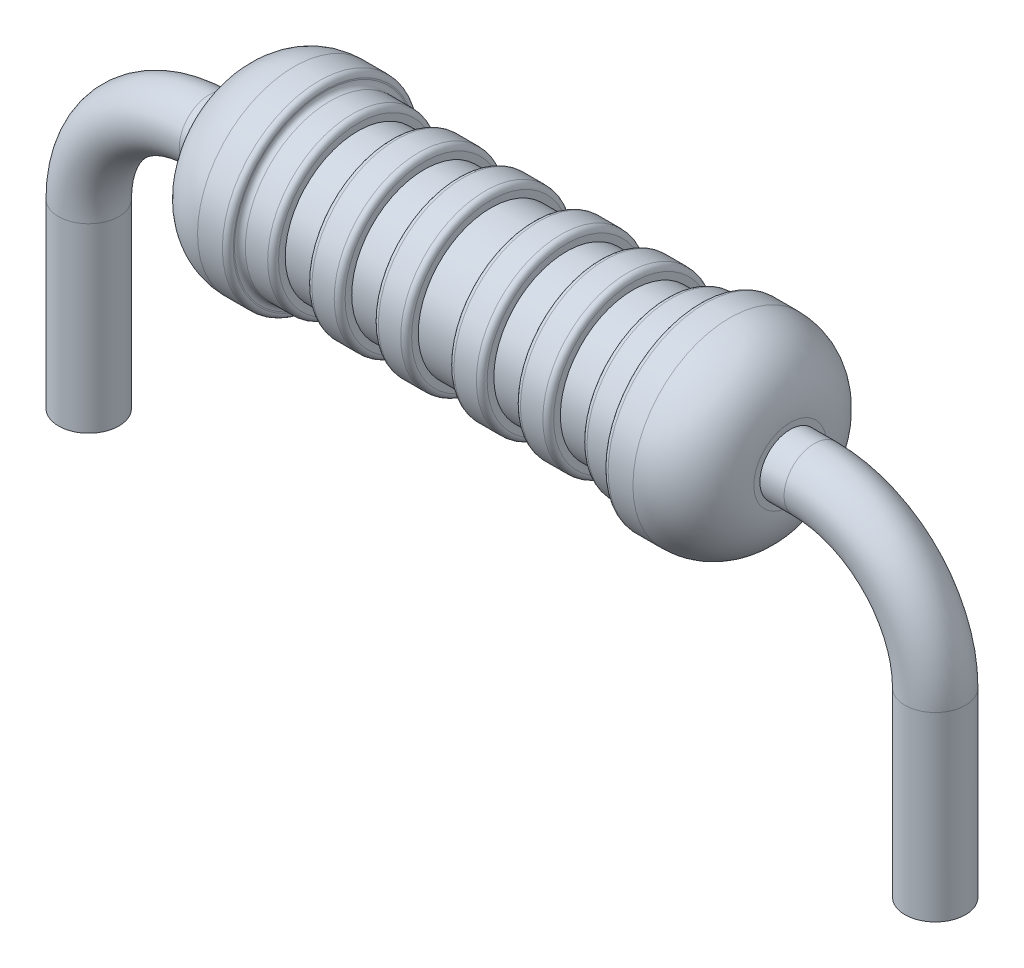
ISO-10303-21;
HEADER;
FILE_DESCRIPTION(('STEP AP214'),'2;1');
FILE_NAME('part.step','',(''),(''),'','','');
FILE_SCHEMA(('AUTOMOTIVE_DESIGN { 1 0 10303 214 1 1 1 1 }'));
ENDSEC;
DATA;
#1=APPLICATION_CONTEXT('core data for automotive mechanical design processes');
#2=APPLICATION_PROTOCOL_DEFINITION('international standard','automotive_design',2000,#1);
#3=PRODUCT_CONTEXT('',#1,'mechanical');
#4=PRODUCT('Part','Part','',(#3));
#5=PRODUCT_RELATED_PRODUCT_CATEGORY('part','',(#4));
#6=PRODUCT_DEFINITION_FORMATION('','',#4);
#7=PRODUCT_DEFINITION_CONTEXT('part definition',#1,'design');
#8=PRODUCT_DEFINITION('design','',#6,#7);
#9=PRODUCT_DEFINITION_SHAPE('','',#8);
#10=(LENGTH_UNIT() NAMED_UNIT(*) SI_UNIT(.MILLI.,.METRE.));
#11=(NAMED_UNIT(*) PLANE_ANGLE_UNIT() SI_UNIT($,.RADIAN.));
#12=(NAMED_UNIT(*) SI_UNIT($,.STERADIAN.) SOLID_ANGLE_UNIT());
#13=UNCERTAINTY_MEASURE_WITH_UNIT(LENGTH_MEASURE(1.E-05),#10,'distance_accuracy_value','');
#14=(GEOMETRIC_REPRESENTATION_CONTEXT(3) GLOBAL_UNCERTAINTY_ASSIGNED_CONTEXT((#13)) GLOBAL_UNIT_ASSIGNED_CONTEXT((#10,
#11,#12)) REPRESENTATION_CONTEXT('',''));
#15=CARTESIAN_POINT('',(0.,0.,0.));
#16=DIRECTION('',(0.,0.,1.));
#17=DIRECTION('',(1.,0.,0.));
#18=AXIS2_PLACEMENT_3D('',#15,#16,#17);
#19=CARTESIAN_POINT('',(5.,5.,0.));
#20=DIRECTION('',(-1.,0.,0.));
#21=DIRECTION('',(0.,0.,1.));
#22=AXIS2_PLACEMENT_3D('',#19,#20,#21);
#23=CYLINDRICAL_SURFACE('',#22,0.500000000000001);
#24=CARTESIAN_POINT('',(4.6,5.,0.));
#25=DIRECTION('',(1.,0.,0.));
#26=DIRECTION('',(0.,0.,-1.));
#27=AXIS2_PLACEMENT_3D('',#24,#25,#26);
#28=CIRCLE('',#27,0.500000000000001);
#29=CARTESIAN_POINT('',(4.6,5.,-0.500000000000001));
#30=VERTEX_POINT('',#29);
#31=EDGE_CURVE('E46',#30,#30,#28,.T.);
#32=ORIENTED_EDGE('',*,*,#31,.T.);
#33=EDGE_LOOP('',(#32));
#34=FACE_BOUND('',#33,.T.);
#35=CARTESIAN_POINT('',(5.,5.,0.));
#36=DIRECTION('',(1.,0.,0.));
#37=DIRECTION('',(0.,0.,1.));
#38=AXIS2_PLACEMENT_3D('',#35,#36,#37);
#39=CIRCLE('',#38,0.500000000000001);
#40=CARTESIAN_POINT('',(5.,5.5,0.));
#41=VERTEX_POINT('',#40);
#42=EDGE_CURVE('E448',#41,#41,#39,.T.);
#43=ORIENTED_EDGE('',*,*,#42,.F.);
#44=EDGE_LOOP('',(#43));
#45=FACE_BOUND('',#44,.T.);
#46=ADVANCED_FACE('F42',(#34,#45),#23,.T.);
#47=CARTESIAN_POINT('',(7.,0.,0.));
#48=DIRECTION('',(0.,-1.,0.));
#49=DIRECTION('',(0.,0.,1.));
#50=AXIS2_PLACEMENT_3D('',#47,#48,#49);
#51=PLANE('',#50);
#52=CARTESIAN_POINT('',(7.,0.,0.));
#53=DIRECTION('',(0.,-1.,0.));
#54=DIRECTION('',(0.,0.,1.));
#55=AXIS2_PLACEMENT_3D('',#52,#53,#54);
#56=CIRCLE('',#55,0.500000000000001);
#57=CARTESIAN_POINT('',(7.,0.,0.500000000000001));
#58=VERTEX_POINT('',#57);
#59=EDGE_CURVE('E58',#58,#58,#56,.T.);
#60=ORIENTED_EDGE('',*,*,#59,.T.);
#61=EDGE_LOOP('',(#60));
#62=FACE_BOUND('',#61,.T.);
#63=ADVANCED_FACE('F44',(#62),#51,.T.);
#64=CARTESIAN_POINT('',(7.,0.,0.));
#65=DIRECTION('',(0.,1.,0.));
#66=DIRECTION('',(-1.,0.,0.));
#67=AXIS2_PLACEMENT_3D('',#64,#65,#66);
#68=CYLINDRICAL_SURFACE('',#67,0.500000000000001);
#69=CARTESIAN_POINT('',(7.,3.,0.));
#70=DIRECTION('',(0.,-1.,0.));
#71=DIRECTION('',(0.,0.,1.));
#72=AXIS2_PLACEMENT_3D('',#69,#70,#71);
#73=CIRCLE('',#72,0.500000000000001);
#74=CARTESIAN_POINT('',(7.5,3.,0.));
#75=VERTEX_POINT('',#74);
#76=EDGE_CURVE('E444',#75,#75,#73,.T.);
#77=ORIENTED_EDGE('',*,*,#76,.T.);
#78=EDGE_LOOP('',(#77));
#79=FACE_BOUND('',#78,.T.);
#80=ORIENTED_EDGE('',*,*,#59,.F.);
#81=EDGE_LOOP('',(#80));
#82=FACE_BOUND('',#81,.T.);
#83=ADVANCED_FACE('F84',(#79,#82),#68,.T.);
#84=CARTESIAN_POINT('',(5.,3.,0.));
#85=DIRECTION('',(0.,0.,1.));
#86=DIRECTION('',(1.,0.,0.));
#87=AXIS2_PLACEMENT_3D('',#84,#85,#86);
#88=TOROIDAL_SURFACE('',#87,2.,0.500000000000001);
#89=CARTESIAN_POINT('',(5.,3.,0.));
#90=DIRECTION('',(0.,0.,1.));
#91=DIRECTION('',(1.,0.,0.));
#92=AXIS2_PLACEMENT_3D('',#89,#90,#91);
#93=CIRCLE('',#92,2.5);
#94=EDGE_CURVE('',#75,#41,#93,.T.);
#95=ORIENTED_EDGE('',*,*,#76,.F.);
#96=ORIENTED_EDGE('',*,*,#42,.T.);
#97=ORIENTED_EDGE('',*,*,#94,.T.);
#98=ORIENTED_EDGE('',*,*,#94,.F.);
#99=EDGE_LOOP('',(#95,#97,#96,#98));
#100=FACE_BOUND('',#99,.T.);
#101=ADVANCED_FACE('F80',(#100),#88,.T.);
#102=CARTESIAN_POINT('',(-4.6,5.,0.));
#103=DIRECTION('',(-1.,0.,0.));
#104=DIRECTION('',(0.,0.,1.));
#105=AXIS2_PLACEMENT_3D('',#102,#103,#104);
#106=CYLINDRICAL_SURFACE('',#105,1.2);
#107=CARTESIAN_POINT('',(-2.,5.,0.));
#108=DIRECTION('',(-1.,0.,0.));
#109=DIRECTION('',(0.,0.,1.));
#110=AXIS2_PLACEMENT_3D('',#107,#108,#109);
#111=CIRCLE('',#110,1.2);
#112=CARTESIAN_POINT('',(-2.,5.,1.2));
#113=VERTEX_POINT('',#112);
#114=EDGE_CURVE('E437',#113,#113,#111,.T.);
#115=ORIENTED_EDGE('',*,*,#114,.T.);
#116=EDGE_LOOP('',(#115));
#117=FACE_BOUND('',#116,.T.);
#118=CARTESIAN_POINT('',(-2.55,5.,0.));
#119=DIRECTION('',(-1.,0.,0.));
#120=DIRECTION('',(0.,0.,1.));
#121=AXIS2_PLACEMENT_3D('',#118,#119,#120);
#122=CIRCLE('',#121,1.2);
#123=CARTESIAN_POINT('',(-2.55,5.,1.2));
#124=VERTEX_POINT('',#123);
#125=EDGE_CURVE('E287',#124,#124,#122,.T.);
#126=ORIENTED_EDGE('',*,*,#125,.F.);
#127=EDGE_LOOP('',(#126));
#128=FACE_BOUND('',#127,.T.);
#129=ADVANCED_FACE('F86',(#117,#128),#106,.T.);
#130=CARTESIAN_POINT('',(-2.,3.8,0.));
#131=DIRECTION('',(-1.,0.,0.));
#132=DIRECTION('',(0.,0.,1.));
#133=AXIS2_PLACEMENT_3D('',#130,#131,#132);
#134=PLANE('',#133);
#135=CARTESIAN_POINT('',(-2.,5.,0.));
#136=DIRECTION('',(-1.,0.,0.));
#137=DIRECTION('',(0.,0.,1.));
#138=AXIS2_PLACEMENT_3D('',#135,#136,#137);
#139=CIRCLE('',#138,1.31);
#140=CARTESIAN_POINT('',(-2.,5.,1.31));
#141=VERTEX_POINT('',#140);
#142=EDGE_CURVE('E433',#141,#141,#139,.T.);
#143=ORIENTED_EDGE('',*,*,#142,.T.);
#144=EDGE_LOOP('',(#143));
#145=FACE_BOUND('',#144,.T.);
#146=ORIENTED_EDGE('',*,*,#114,.F.);
#147=EDGE_LOOP('',(#146));
#148=FACE_BOUND('',#147,.T.);
#149=ADVANCED_FACE('F99',(#145,#148),#134,.T.);
#150=CARTESIAN_POINT('',(-1.91,5.,0.));
#151=DIRECTION('',(-1.,0.,0.));
#152=DIRECTION('',(0.,0.,1.));
#153=AXIS2_PLACEMENT_3D('',#150,#151,#152);
#154=TOROIDAL_SURFACE('',#153,1.31,0.0900000000000001);
#155=CARTESIAN_POINT('',(-1.91,5.,0.));
#156=DIRECTION('',(-1.,0.,0.));
#157=DIRECTION('',(0.,0.,1.));
#158=AXIS2_PLACEMENT_3D('',#155,#156,#157);
#159=CIRCLE('',#158,1.4);
#160=CARTESIAN_POINT('',(-1.91,5.,1.4));
#161=VERTEX_POINT('',#160);
#162=EDGE_CURVE('E429',#161,#161,#159,.T.);
#163=ORIENTED_EDGE('',*,*,#162,.T.);
#164=EDGE_LOOP('',(#163));
#165=FACE_BOUND('',#164,.T.);
#166=ORIENTED_EDGE('',*,*,#142,.F.);
#167=EDGE_LOOP('',(#166));
#168=FACE_BOUND('',#167,.T.);
#169=ADVANCED_FACE('F109',(#165,#168),#154,.T.);
#170=CARTESIAN_POINT('',(-4.6,5.,0.));
#171=DIRECTION('',(-1.,0.,0.));
#172=DIRECTION('',(0.,0.,1.));
#173=AXIS2_PLACEMENT_3D('',#170,#171,#172);
#174=CYLINDRICAL_SURFACE('',#173,1.4);
#175=CARTESIAN_POINT('',(-1.54,5.,0.));
#176=DIRECTION('',(-1.,0.,0.));
#177=DIRECTION('',(0.,0.,1.));
#178=AXIS2_PLACEMENT_3D('',#175,#176,#177);
#179=CIRCLE('',#178,1.4);
#180=CARTESIAN_POINT('',(-1.54,5.,1.4));
#181=VERTEX_POINT('',#180);
#182=EDGE_CURVE('E425',#181,#181,#179,.T.);
#183=ORIENTED_EDGE('',*,*,#182,.T.);
#184=EDGE_LOOP('',(#183));
#185=FACE_BOUND('',#184,.T.);
#186=ORIENTED_EDGE('',*,*,#162,.F.);
#187=EDGE_LOOP('',(#186));
#188=FACE_BOUND('',#187,.T.);
#189=ADVANCED_FACE('F113',(#185,#188),#174,.T.);
#190=CARTESIAN_POINT('',(-1.54,5.,0.));
#191=DIRECTION('',(-1.,0.,0.));
#192=DIRECTION('',(0.,0.,1.));
#193=AXIS2_PLACEMENT_3D('',#190,#191,#192);
#194=TOROIDAL_SURFACE('',#193,1.31,0.0899999999999999);
#195=CARTESIAN_POINT('',(-1.45,5.,0.));
#196=DIRECTION('',(-1.,0.,0.));
#197=DIRECTION('',(0.,0.,1.));
#198=AXIS2_PLACEMENT_3D('',#195,#196,#197);
#199=CIRCLE('',#198,1.31);
#200=CARTESIAN_POINT('',(-1.45,5.,1.31));
#201=VERTEX_POINT('',#200);
#202=EDGE_CURVE('E421',#201,#201,#199,.T.);
#203=ORIENTED_EDGE('',*,*,#202,.T.);
#204=EDGE_LOOP('',(#203));
#205=FACE_BOUND('',#204,.T.);
#206=ORIENTED_EDGE('',*,*,#182,.F.);
#207=EDGE_LOOP('',(#206));
#208=FACE_BOUND('',#207,.T.);
#209=ADVANCED_FACE('F117',(#205,#208),#194,.T.);
#210=CARTESIAN_POINT('',(-1.45,3.69,0.));
#211=DIRECTION('',(1.,0.,0.));
#212=DIRECTION('',(0.,0.,-1.));
#213=AXIS2_PLACEMENT_3D('',#210,#211,#212);
#214=PLANE('',#213);
#215=CARTESIAN_POINT('',(-1.45,5.,0.));
#216=DIRECTION('',(-1.,0.,0.));
#217=DIRECTION('',(0.,0.,1.));
#218=AXIS2_PLACEMENT_3D('',#215,#216,#217);
#219=CIRCLE('',#218,1.2);
#220=CARTESIAN_POINT('',(-1.45,5.,1.2));
#221=VERTEX_POINT('',#220);
#222=EDGE_CURVE('E417',#221,#221,#219,.T.);
#223=ORIENTED_EDGE('',*,*,#222,.T.);
#224=EDGE_LOOP('',(#223));
#225=FACE_BOUND('',#224,.T.);
#226=ORIENTED_EDGE('',*,*,#202,.F.);
#227=EDGE_LOOP('',(#226));
#228=FACE_BOUND('',#227,.T.);
#229=ADVANCED_FACE('F121',(#225,#228),#214,.T.);
#230=CARTESIAN_POINT('',(-4.6,5.,0.));
#231=DIRECTION('',(-1.,0.,0.));
#232=DIRECTION('',(0.,0.,1.));
#233=AXIS2_PLACEMENT_3D('',#230,#231,#232);
#234=CYLINDRICAL_SURFACE('',#233,1.2);
#235=CARTESIAN_POINT('',(-0.899999999999999,5.,0.));
#236=DIRECTION('',(-1.,0.,0.));
#237=DIRECTION('',(0.,0.,1.));
#238=AXIS2_PLACEMENT_3D('',#235,#236,#237);
#239=CIRCLE('',#238,1.2);
#240=CARTESIAN_POINT('',(-0.899999999999999,5.,1.2));
#241=VERTEX_POINT('',#240);
#242=EDGE_CURVE('E413',#241,#241,#239,.T.);
#243=ORIENTED_EDGE('',*,*,#242,.T.);
#244=EDGE_LOOP('',(#243));
#245=FACE_BOUND('',#244,.T.);
#246=ORIENTED_EDGE('',*,*,#222,.F.);
#247=EDGE_LOOP('',(#246));
#248=FACE_BOUND('',#247,.T.);
#249=ADVANCED_FACE('F125',(#245,#248),#234,.T.);
#250=CARTESIAN_POINT('',(-0.9,3.8,0.));
#251=DIRECTION('',(-1.,0.,0.));
#252=DIRECTION('',(0.,0.,1.));
#253=AXIS2_PLACEMENT_3D('',#250,#251,#252);
#254=PLANE('',#253);
#255=CARTESIAN_POINT('',(-0.9,5.,0.));
#256=DIRECTION('',(-1.,0.,0.));
#257=DIRECTION('',(0.,0.,1.));
#258=AXIS2_PLACEMENT_3D('',#255,#256,#257);
#259=CIRCLE('',#258,1.31);
#260=CARTESIAN_POINT('',(-0.9,5.,1.31));
#261=VERTEX_POINT('',#260);
#262=EDGE_CURVE('E409',#261,#261,#259,.T.);
#263=ORIENTED_EDGE('',*,*,#262,.T.);
#264=EDGE_LOOP('',(#263));
#265=FACE_BOUND('',#264,.T.);
#266=ORIENTED_EDGE('',*,*,#242,.F.);
#267=EDGE_LOOP('',(#266));
#268=FACE_BOUND('',#267,.T.);
#269=ADVANCED_FACE('F129',(#265,#268),#254,.T.);
#270=CARTESIAN_POINT('',(-0.809999999999999,5.,0.));
#271=DIRECTION('',(-1.,0.,0.));
#272=DIRECTION('',(0.,0.,1.));
#273=AXIS2_PLACEMENT_3D('',#270,#271,#272);
#274=TOROIDAL_SURFACE('',#273,1.31,0.0900000000000001);
#275=CARTESIAN_POINT('',(-0.809999999999999,5.,0.));
#276=DIRECTION('',(-1.,0.,0.));
#277=DIRECTION('',(0.,0.,1.));
#278=AXIS2_PLACEMENT_3D('',#275,#276,#277);
#279=CIRCLE('',#278,1.4);
#280=CARTESIAN_POINT('',(-0.809999999999999,5.,1.4));
#281=VERTEX_POINT('',#280);
#282=EDGE_CURVE('E405',#281,#281,#279,.T.);
#283=ORIENTED_EDGE('',*,*,#282,.T.);
#284=EDGE_LOOP('',(#283));
#285=FACE_BOUND('',#284,.T.);
#286=ORIENTED_EDGE('',*,*,#262,.F.);
#287=EDGE_LOOP('',(#286));
#288=FACE_BOUND('',#287,.T.);
#289=ADVANCED_FACE('F133',(#285,#288),#274,.T.);
#290=CARTESIAN_POINT('',(-4.6,5.,0.));
#291=DIRECTION('',(-1.,0.,0.));
#292=DIRECTION('',(0.,0.,1.));
#293=AXIS2_PLACEMENT_3D('',#290,#291,#292);
#294=CYLINDRICAL_SURFACE('',#293,1.4);
#295=CARTESIAN_POINT('',(-0.44,5.,0.));
#296=DIRECTION('',(-1.,0.,0.));
#297=DIRECTION('',(0.,0.,1.));
#298=AXIS2_PLACEMENT_3D('',#295,#296,#297);
#299=CIRCLE('',#298,1.4);
#300=CARTESIAN_POINT('',(-0.44,5.,1.4));
#301=VERTEX_POINT('',#300);
#302=EDGE_CURVE('E401',#301,#301,#299,.T.);
#303=ORIENTED_EDGE('',*,*,#302,.T.);
#304=EDGE_LOOP('',(#303));
#305=FACE_BOUND('',#304,.T.);
#306=ORIENTED_EDGE('',*,*,#282,.F.);
#307=EDGE_LOOP('',(#306));
#308=FACE_BOUND('',#307,.T.);
#309=ADVANCED_FACE('F137',(#305,#308),#294,.T.);
#310=CARTESIAN_POINT('',(-0.439999999999999,5.,0.));
#311=DIRECTION('',(-1.,0.,0.));
#312=DIRECTION('',(0.,0.,1.));
#313=AXIS2_PLACEMENT_3D('',#310,#311,#312);
#314=TOROIDAL_SURFACE('',#313,1.31,0.0899999999999999);
#315=CARTESIAN_POINT('',(-0.35,5.,0.));
#316=DIRECTION('',(-1.,0.,0.));
#317=DIRECTION('',(0.,0.,1.));
#318=AXIS2_PLACEMENT_3D('',#315,#316,#317);
#319=CIRCLE('',#318,1.31);
#320=CARTESIAN_POINT('',(-0.35,5.,1.31));
#321=VERTEX_POINT('',#320);
#322=EDGE_CURVE('E397',#321,#321,#319,.T.);
#323=ORIENTED_EDGE('',*,*,#322,.T.);
#324=EDGE_LOOP('',(#323));
#325=FACE_BOUND('',#324,.T.);
#326=ORIENTED_EDGE('',*,*,#302,.F.);
#327=EDGE_LOOP('',(#326));
#328=FACE_BOUND('',#327,.T.);
#329=ADVANCED_FACE('F141',(#325,#328),#314,.T.);
#330=CARTESIAN_POINT('',(-0.349999999999999,3.69,0.));
#331=DIRECTION('',(1.,0.,0.));
#332=DIRECTION('',(0.,0.,-1.));
#333=AXIS2_PLACEMENT_3D('',#330,#331,#332);
#334=PLANE('',#333);
#335=CARTESIAN_POINT('',(-0.35,5.,0.));
#336=DIRECTION('',(-1.,0.,0.));
#337=DIRECTION('',(0.,0.,1.));
#338=AXIS2_PLACEMENT_3D('',#335,#336,#337);
#339=CIRCLE('',#338,1.2);
#340=CARTESIAN_POINT('',(-0.35,5.,1.2));
#341=VERTEX_POINT('',#340);
#342=EDGE_CURVE('E393',#341,#341,#339,.T.);
#343=ORIENTED_EDGE('',*,*,#342,.T.);
#344=EDGE_LOOP('',(#343));
#345=FACE_BOUND('',#344,.T.);
#346=ORIENTED_EDGE('',*,*,#322,.F.);
#347=EDGE_LOOP('',(#346));
#348=FACE_BOUND('',#347,.T.);
#349=ADVANCED_FACE('F145',(#345,#348),#334,.T.);
#350=CARTESIAN_POINT('',(-4.6,5.,0.));
#351=DIRECTION('',(-1.,0.,0.));
#352=DIRECTION('',(0.,0.,1.));
#353=AXIS2_PLACEMENT_3D('',#350,#351,#352);
#354=CYLINDRICAL_SURFACE('',#353,1.2);
#355=CARTESIAN_POINT('',(0.35,5.,0.));
#356=DIRECTION('',(-1.,0.,0.));
#357=DIRECTION('',(0.,0.,1.));
#358=AXIS2_PLACEMENT_3D('',#355,#356,#357);
#359=CIRCLE('',#358,1.2);
#360=CARTESIAN_POINT('',(0.35,5.,1.2));
#361=VERTEX_POINT('',#360);
#362=EDGE_CURVE('E389',#361,#361,#359,.T.);
#363=ORIENTED_EDGE('',*,*,#362,.T.);
#364=EDGE_LOOP('',(#363));
#365=FACE_BOUND('',#364,.T.);
#366=ORIENTED_EDGE('',*,*,#342,.F.);
#367=EDGE_LOOP('',(#366));
#368=FACE_BOUND('',#367,.T.);
#369=ADVANCED_FACE('F149',(#365,#368),#354,.T.);
#370=CARTESIAN_POINT('',(0.349999999999999,3.69,0.));
#371=DIRECTION('',(-1.,0.,0.));
#372=DIRECTION('',(0.,0.,1.));
#373=AXIS2_PLACEMENT_3D('',#370,#371,#372);
#374=PLANE('',#373);
#375=CARTESIAN_POINT('',(0.35,5.,0.));
#376=DIRECTION('',(-1.,0.,0.));
#377=DIRECTION('',(0.,0.,1.));
#378=AXIS2_PLACEMENT_3D('',#375,#376,#377);
#379=CIRCLE('',#378,1.31);
#380=CARTESIAN_POINT('',(0.35,5.,1.31));
#381=VERTEX_POINT('',#380);
#382=EDGE_CURVE('E385',#381,#381,#379,.T.);
#383=ORIENTED_EDGE('',*,*,#382,.T.);
#384=EDGE_LOOP('',(#383));
#385=FACE_BOUND('',#384,.T.);
#386=ORIENTED_EDGE('',*,*,#362,.F.);
#387=EDGE_LOOP('',(#386));
#388=FACE_BOUND('',#387,.T.);
#389=ADVANCED_FACE('F153',(#385,#388),#374,.T.);
#390=CARTESIAN_POINT('',(0.439999999999999,5.,0.));
#391=DIRECTION('',(-1.,0.,0.));
#392=DIRECTION('',(0.,0.,1.));
#393=AXIS2_PLACEMENT_3D('',#390,#391,#392);
#394=TOROIDAL_SURFACE('',#393,1.31,0.0899999999999999);
#395=CARTESIAN_POINT('',(0.44,5.,0.));
#396=DIRECTION('',(-1.,0.,0.));
#397=DIRECTION('',(0.,0.,1.));
#398=AXIS2_PLACEMENT_3D('',#395,#396,#397);
#399=CIRCLE('',#398,1.4);
#400=CARTESIAN_POINT('',(0.44,5.,1.4));
#401=VERTEX_POINT('',#400);
#402=EDGE_CURVE('E381',#401,#401,#399,.T.);
#403=ORIENTED_EDGE('',*,*,#402,.T.);
#404=EDGE_LOOP('',(#403));
#405=FACE_BOUND('',#404,.T.);
#406=ORIENTED_EDGE('',*,*,#382,.F.);
#407=EDGE_LOOP('',(#406));
#408=FACE_BOUND('',#407,.T.);
#409=ADVANCED_FACE('F157',(#405,#408),#394,.T.);
#410=CARTESIAN_POINT('',(-4.6,5.,0.));
#411=DIRECTION('',(-1.,0.,0.));
#412=DIRECTION('',(0.,0.,1.));
#413=AXIS2_PLACEMENT_3D('',#410,#411,#412);
#414=CYLINDRICAL_SURFACE('',#413,1.4);
#415=CARTESIAN_POINT('',(0.809999999999998,5.,0.));
#416=DIRECTION('',(-1.,0.,0.));
#417=DIRECTION('',(0.,0.,1.));
#418=AXIS2_PLACEMENT_3D('',#415,#416,#417);
#419=CIRCLE('',#418,1.4);
#420=CARTESIAN_POINT('',(0.809999999999998,5.,1.4));
#421=VERTEX_POINT('',#420);
#422=EDGE_CURVE('E377',#421,#421,#419,.T.);
#423=ORIENTED_EDGE('',*,*,#422,.T.);
#424=EDGE_LOOP('',(#423));
#425=FACE_BOUND('',#424,.T.);
#426=ORIENTED_EDGE('',*,*,#402,.F.);
#427=EDGE_LOOP('',(#426));
#428=FACE_BOUND('',#427,.T.);
#429=ADVANCED_FACE('F161',(#425,#428),#414,.T.);
#430=CARTESIAN_POINT('',(0.809999999999999,5.,0.));
#431=DIRECTION('',(-1.,0.,0.));
#432=DIRECTION('',(0.,0.,1.));
#433=AXIS2_PLACEMENT_3D('',#430,#431,#432);
#434=TOROIDAL_SURFACE('',#433,1.31,0.0900000000000001);
#435=CARTESIAN_POINT('',(0.9,5.,0.));
#436=DIRECTION('',(-1.,0.,0.));
#437=DIRECTION('',(0.,0.,1.));
#438=AXIS2_PLACEMENT_3D('',#435,#436,#437);
#439=CIRCLE('',#438,1.31);
#440=CARTESIAN_POINT('',(0.9,5.,1.31));
#441=VERTEX_POINT('',#440);
#442=EDGE_CURVE('E373',#441,#441,#439,.T.);
#443=ORIENTED_EDGE('',*,*,#442,.T.);
#444=EDGE_LOOP('',(#443));
#445=FACE_BOUND('',#444,.T.);
#446=ORIENTED_EDGE('',*,*,#422,.F.);
#447=EDGE_LOOP('',(#446));
#448=FACE_BOUND('',#447,.T.);
#449=ADVANCED_FACE('F165',(#445,#448),#434,.T.);
#450=CARTESIAN_POINT('',(0.899999999999999,3.8,0.));
#451=DIRECTION('',(1.,0.,0.));
#452=DIRECTION('',(0.,0.,-1.));
#453=AXIS2_PLACEMENT_3D('',#450,#451,#452);
#454=PLANE('',#453);
#455=CARTESIAN_POINT('',(0.9,5.,0.));
#456=DIRECTION('',(-1.,0.,0.));
#457=DIRECTION('',(0.,0.,1.));
#458=AXIS2_PLACEMENT_3D('',#455,#456,#457);
#459=CIRCLE('',#458,1.2);
#460=CARTESIAN_POINT('',(0.9,5.,1.2));
#461=VERTEX_POINT('',#460);
#462=EDGE_CURVE('E369',#461,#461,#459,.T.);
#463=ORIENTED_EDGE('',*,*,#462,.T.);
#464=EDGE_LOOP('',(#463));
#465=FACE_BOUND('',#464,.T.);
#466=ORIENTED_EDGE('',*,*,#442,.F.);
#467=EDGE_LOOP('',(#466));
#468=FACE_BOUND('',#467,.T.);
#469=ADVANCED_FACE('F169',(#465,#468),#454,.T.);
#470=CARTESIAN_POINT('',(-4.6,5.,0.));
#471=DIRECTION('',(-1.,0.,0.));
#472=DIRECTION('',(0.,0.,1.));
#473=AXIS2_PLACEMENT_3D('',#470,#471,#472);
#474=CYLINDRICAL_SURFACE('',#473,1.2);
#475=CARTESIAN_POINT('',(1.45,5.,0.));
#476=DIRECTION('',(-1.,0.,0.));
#477=DIRECTION('',(0.,0.,1.));
#478=AXIS2_PLACEMENT_3D('',#475,#476,#477);
#479=CIRCLE('',#478,1.2);
#480=CARTESIAN_POINT('',(1.45,5.,1.2));
#481=VERTEX_POINT('',#480);
#482=EDGE_CURVE('E365',#481,#481,#479,.T.);
#483=ORIENTED_EDGE('',*,*,#482,.T.);
#484=EDGE_LOOP('',(#483));
#485=FACE_BOUND('',#484,.T.);
#486=ORIENTED_EDGE('',*,*,#462,.F.);
#487=EDGE_LOOP('',(#486));
#488=FACE_BOUND('',#487,.T.);
#489=ADVANCED_FACE('F173',(#485,#488),#474,.T.);
#490=CARTESIAN_POINT('',(1.45,3.69,0.));
#491=DIRECTION('',(-1.,0.,0.));
#492=DIRECTION('',(0.,0.,1.));
#493=AXIS2_PLACEMENT_3D('',#490,#491,#492);
#494=PLANE('',#493);
#495=CARTESIAN_POINT('',(1.45,5.,0.));
#496=DIRECTION('',(-1.,0.,0.));
#497=DIRECTION('',(0.,0.,1.));
#498=AXIS2_PLACEMENT_3D('',#495,#496,#497);
#499=CIRCLE('',#498,1.31);
#500=CARTESIAN_POINT('',(1.45,5.,1.31));
#501=VERTEX_POINT('',#500);
#502=EDGE_CURVE('E361',#501,#501,#499,.T.);
#503=ORIENTED_EDGE('',*,*,#502,.T.);
#504=EDGE_LOOP('',(#503));
#505=FACE_BOUND('',#504,.T.);
#506=ORIENTED_EDGE('',*,*,#482,.F.);
#507=EDGE_LOOP('',(#506));
#508=FACE_BOUND('',#507,.T.);
#509=ADVANCED_FACE('F177',(#505,#508),#494,.T.);
#510=CARTESIAN_POINT('',(1.54,5.,0.));
#511=DIRECTION('',(-1.,0.,0.));
#512=DIRECTION('',(0.,0.,1.));
#513=AXIS2_PLACEMENT_3D('',#510,#511,#512);
#514=TOROIDAL_SURFACE('',#513,1.31,0.0899999999999999);
#515=CARTESIAN_POINT('',(1.54,5.,0.));
#516=DIRECTION('',(-1.,0.,0.));
#517=DIRECTION('',(0.,0.,1.));
#518=AXIS2_PLACEMENT_3D('',#515,#516,#517);
#519=CIRCLE('',#518,1.4);
#520=CARTESIAN_POINT('',(1.54,5.,1.4));
#521=VERTEX_POINT('',#520);
#522=EDGE_CURVE('E357',#521,#521,#519,.T.);
#523=ORIENTED_EDGE('',*,*,#522,.T.);
#524=EDGE_LOOP('',(#523));
#525=FACE_BOUND('',#524,.T.);
#526=ORIENTED_EDGE('',*,*,#502,.F.);
#527=EDGE_LOOP('',(#526));
#528=FACE_BOUND('',#527,.T.);
#529=ADVANCED_FACE('F181',(#525,#528),#514,.T.);
#530=CARTESIAN_POINT('',(-4.6,5.,0.));
#531=DIRECTION('',(-1.,0.,0.));
#532=DIRECTION('',(0.,0.,1.));
#533=AXIS2_PLACEMENT_3D('',#530,#531,#532);
#534=CYLINDRICAL_SURFACE('',#533,1.4);
#535=CARTESIAN_POINT('',(1.91,5.,0.));
#536=DIRECTION('',(-1.,0.,0.));
#537=DIRECTION('',(0.,0.,1.));
#538=AXIS2_PLACEMENT_3D('',#535,#536,#537);
#539=CIRCLE('',#538,1.4);
#540=CARTESIAN_POINT('',(1.91,5.,1.4));
#541=VERTEX_POINT('',#540);
#542=EDGE_CURVE('E353',#541,#541,#539,.T.);
#543=ORIENTED_EDGE('',*,*,#542,.T.);
#544=EDGE_LOOP('',(#543));
#545=FACE_BOUND('',#544,.T.);
#546=ORIENTED_EDGE('',*,*,#522,.F.);
#547=EDGE_LOOP('',(#546));
#548=FACE_BOUND('',#547,.T.);
#549=ADVANCED_FACE('F185',(#545,#548),#534,.T.);
#550=CARTESIAN_POINT('',(1.91,5.,0.));
#551=DIRECTION('',(-1.,0.,0.));
#552=DIRECTION('',(0.,0.,1.));
#553=AXIS2_PLACEMENT_3D('',#550,#551,#552);
#554=TOROIDAL_SURFACE('',#553,1.31,0.0900000000000001);
#555=CARTESIAN_POINT('',(2.,5.,0.));
#556=DIRECTION('',(-1.,0.,0.));
#557=DIRECTION('',(0.,0.,1.));
#558=AXIS2_PLACEMENT_3D('',#555,#556,#557);
#559=CIRCLE('',#558,1.31);
#560=CARTESIAN_POINT('',(2.,5.,1.31));
#561=VERTEX_POINT('',#560);
#562=EDGE_CURVE('E349',#561,#561,#559,.T.);
#563=ORIENTED_EDGE('',*,*,#562,.T.);
#564=EDGE_LOOP('',(#563));
#565=FACE_BOUND('',#564,.T.);
#566=ORIENTED_EDGE('',*,*,#542,.F.);
#567=EDGE_LOOP('',(#566));
#568=FACE_BOUND('',#567,.T.);
#569=ADVANCED_FACE('F189',(#565,#568),#554,.T.);
#570=CARTESIAN_POINT('',(2.,3.8,0.));
#571=DIRECTION('',(1.,0.,0.));
#572=DIRECTION('',(0.,0.,-1.));
#573=AXIS2_PLACEMENT_3D('',#570,#571,#572);
#574=PLANE('',#573);
#575=CARTESIAN_POINT('',(2.,5.,0.));
#576=DIRECTION('',(-1.,0.,0.));
#577=DIRECTION('',(0.,0.,1.));
#578=AXIS2_PLACEMENT_3D('',#575,#576,#577);
#579=CIRCLE('',#578,1.2);
#580=CARTESIAN_POINT('',(2.,5.,1.2));
#581=VERTEX_POINT('',#580);
#582=EDGE_CURVE('E345',#581,#581,#579,.T.);
#583=ORIENTED_EDGE('',*,*,#582,.T.);
#584=EDGE_LOOP('',(#583));
#585=FACE_BOUND('',#584,.T.);
#586=ORIENTED_EDGE('',*,*,#562,.F.);
#587=EDGE_LOOP('',(#586));
#588=FACE_BOUND('',#587,.T.);
#589=ADVANCED_FACE('F193',(#585,#588),#574,.T.);
#590=CARTESIAN_POINT('',(-4.6,5.,0.));
#591=DIRECTION('',(-1.,0.,0.));
#592=DIRECTION('',(0.,0.,1.));
#593=AXIS2_PLACEMENT_3D('',#590,#591,#592);
#594=CYLINDRICAL_SURFACE('',#593,1.2);
#595=CARTESIAN_POINT('',(2.55,5.,0.));
#596=DIRECTION('',(-1.,0.,0.));
#597=DIRECTION('',(0.,0.,1.));
#598=AXIS2_PLACEMENT_3D('',#595,#596,#597);
#599=CIRCLE('',#598,1.2);
#600=CARTESIAN_POINT('',(2.55,5.,1.2));
#601=VERTEX_POINT('',#600);
#602=EDGE_CURVE('E341',#601,#601,#599,.T.);
#603=ORIENTED_EDGE('',*,*,#602,.T.);
#604=EDGE_LOOP('',(#603));
#605=FACE_BOUND('',#604,.T.);
#606=ORIENTED_EDGE('',*,*,#582,.F.);
#607=EDGE_LOOP('',(#606));
#608=FACE_BOUND('',#607,.T.);
#609=ADVANCED_FACE('F197',(#605,#608),#594,.T.);
#610=CARTESIAN_POINT('',(2.55,3.69,0.));
#611=DIRECTION('',(-1.,0.,0.));
#612=DIRECTION('',(0.,0.,1.));
#613=AXIS2_PLACEMENT_3D('',#610,#611,#612);
#614=PLANE('',#613);
#615=CARTESIAN_POINT('',(2.55,5.,0.));
#616=DIRECTION('',(-1.,0.,0.));
#617=DIRECTION('',(0.,0.,1.));
#618=AXIS2_PLACEMENT_3D('',#615,#616,#617);
#619=CIRCLE('',#618,1.31);
#620=CARTESIAN_POINT('',(2.55,5.,1.31));
#621=VERTEX_POINT('',#620);
#622=EDGE_CURVE('E337',#621,#621,#619,.T.);
#623=ORIENTED_EDGE('',*,*,#622,.T.);
#624=EDGE_LOOP('',(#623));
#625=FACE_BOUND('',#624,.T.);
#626=ORIENTED_EDGE('',*,*,#602,.F.);
#627=EDGE_LOOP('',(#626));
#628=FACE_BOUND('',#627,.T.);
#629=ADVANCED_FACE('F201',(#625,#628),#614,.T.);
#630=CARTESIAN_POINT('',(2.64,5.,0.));
#631=DIRECTION('',(-1.,0.,0.));
#632=DIRECTION('',(0.,0.,1.));
#633=AXIS2_PLACEMENT_3D('',#630,#631,#632);
#634=TOROIDAL_SURFACE('',#633,1.31,0.0899999999999998);
#635=CARTESIAN_POINT('',(2.64,5.,0.));
#636=DIRECTION('',(-1.,0.,0.));
#637=DIRECTION('',(0.,0.,1.));
#638=AXIS2_PLACEMENT_3D('',#635,#636,#637);
#639=CIRCLE('',#638,1.4);
#640=CARTESIAN_POINT('',(2.64,5.,1.4));
#641=VERTEX_POINT('',#640);
#642=EDGE_CURVE('E333',#641,#641,#639,.T.);
#643=ORIENTED_EDGE('',*,*,#642,.T.);
#644=EDGE_LOOP('',(#643));
#645=FACE_BOUND('',#644,.T.);
#646=ORIENTED_EDGE('',*,*,#622,.F.);
#647=EDGE_LOOP('',(#646));
#648=FACE_BOUND('',#647,.T.);
#649=ADVANCED_FACE('F205',(#645,#648),#634,.T.);
#650=CARTESIAN_POINT('',(-4.6,5.,0.));
#651=DIRECTION('',(-1.,0.,0.));
#652=DIRECTION('',(0.,0.,1.));
#653=AXIS2_PLACEMENT_3D('',#650,#651,#652);
#654=CYLINDRICAL_SURFACE('',#653,1.4);
#655=CARTESIAN_POINT('',(3.01,5.,0.));
#656=DIRECTION('',(-1.,0.,0.));
#657=DIRECTION('',(0.,0.,1.));
#658=AXIS2_PLACEMENT_3D('',#655,#656,#657);
#659=CIRCLE('',#658,1.4);
#660=CARTESIAN_POINT('',(3.01,5.,1.4));
#661=VERTEX_POINT('',#660);
#662=EDGE_CURVE('E330',#661,#661,#659,.T.);
#663=ORIENTED_EDGE('',*,*,#662,.T.);
#664=EDGE_LOOP('',(#663));
#665=FACE_BOUND('',#664,.T.);
#666=ORIENTED_EDGE('',*,*,#642,.F.);
#667=EDGE_LOOP('',(#666));
#668=FACE_BOUND('',#667,.T.);
#669=ADVANCED_FACE('F209',(#665,#668),#654,.T.);
#670=CARTESIAN_POINT('',(3.01,5.,0.));
#671=DIRECTION('',(-1.,0.,0.));
#672=DIRECTION('',(0.,0.,1.));
#673=AXIS2_PLACEMENT_3D('',#670,#671,#672);
#674=TOROIDAL_SURFACE('',#673,1.49,0.0899999999999998);
#675=CARTESIAN_POINT('',(3.1,5.,0.));
#676=DIRECTION('',(-1.,0.,0.));
#677=DIRECTION('',(0.,0.,1.));
#678=AXIS2_PLACEMENT_3D('',#675,#676,#677);
#679=CIRCLE('',#678,1.49);
#680=CARTESIAN_POINT('',(3.1,5.,1.49));
#681=VERTEX_POINT('',#680);
#682=EDGE_CURVE('E326',#681,#681,#679,.T.);
#683=ORIENTED_EDGE('',*,*,#682,.T.);
#684=EDGE_LOOP('',(#683));
#685=FACE_BOUND('',#684,.T.);
#686=ORIENTED_EDGE('',*,*,#662,.F.);
#687=EDGE_LOOP('',(#686));
#688=FACE_BOUND('',#687,.T.);
#689=ADVANCED_FACE('F213',(#685,#688),#674,.F.);
#690=CARTESIAN_POINT('',(3.1,3.49,0.));
#691=DIRECTION('',(-1.,0.,0.));
#692=DIRECTION('',(0.,0.,1.));
#693=AXIS2_PLACEMENT_3D('',#690,#691,#692);
#694=PLANE('',#693);
#695=CARTESIAN_POINT('',(3.1,5.,0.));
#696=DIRECTION('',(-1.,0.,0.));
#697=DIRECTION('',(0.,0.,1.));
#698=AXIS2_PLACEMENT_3D('',#695,#696,#697);
#699=CIRCLE('',#698,1.51);
#700=CARTESIAN_POINT('',(3.1,5.,1.51));
#701=VERTEX_POINT('',#700);
#702=EDGE_CURVE('E322',#701,#701,#699,.T.);
#703=ORIENTED_EDGE('',*,*,#702,.T.);
#704=EDGE_LOOP('',(#703));
#705=FACE_BOUND('',#704,.T.);
#706=ORIENTED_EDGE('',*,*,#682,.F.);
#707=EDGE_LOOP('',(#706));
#708=FACE_BOUND('',#707,.T.);
#709=ADVANCED_FACE('F217',(#705,#708),#694,.T.);
#710=CARTESIAN_POINT('',(3.19,5.,0.));
#711=DIRECTION('',(-1.,0.,0.));
#712=DIRECTION('',(0.,0.,1.));
#713=AXIS2_PLACEMENT_3D('',#710,#711,#712);
#714=TOROIDAL_SURFACE('',#713,1.51,0.0899999999999998);
#715=CARTESIAN_POINT('',(3.19,5.,0.));
#716=DIRECTION('',(-1.,0.,0.));
#717=DIRECTION('',(0.,0.,1.));
#718=AXIS2_PLACEMENT_3D('',#715,#716,#717);
#719=CIRCLE('',#718,1.6);
#720=CARTESIAN_POINT('',(3.19,5.,1.6));
#721=VERTEX_POINT('',#720);
#722=EDGE_CURVE('E318',#721,#721,#719,.T.);
#723=ORIENTED_EDGE('',*,*,#722,.T.);
#724=EDGE_LOOP('',(#723));
#725=FACE_BOUND('',#724,.T.);
#726=ORIENTED_EDGE('',*,*,#702,.F.);
#727=EDGE_LOOP('',(#726));
#728=FACE_BOUND('',#727,.T.);
#729=ADVANCED_FACE('F221',(#725,#728),#714,.T.);
#730=CARTESIAN_POINT('',(-4.6,5.,0.));
#731=DIRECTION('',(-1.,0.,0.));
#732=DIRECTION('',(0.,0.,1.));
#733=AXIS2_PLACEMENT_3D('',#730,#731,#732);
#734=CYLINDRICAL_SURFACE('',#733,1.6);
#735=CARTESIAN_POINT('',(3.59999999999999,5.,0.));
#736=DIRECTION('',(-1.,0.,0.));
#737=DIRECTION('',(0.,0.,1.));
#738=AXIS2_PLACEMENT_3D('',#735,#736,#737);
#739=CIRCLE('',#738,1.6);
#740=CARTESIAN_POINT('',(3.59999999999999,5.,1.6));
#741=VERTEX_POINT('',#740);
#742=EDGE_CURVE('E314',#741,#741,#739,.T.);
#743=ORIENTED_EDGE('',*,*,#742,.T.);
#744=EDGE_LOOP('',(#743));
#745=FACE_BOUND('',#744,.T.);
#746=ORIENTED_EDGE('',*,*,#722,.F.);
#747=EDGE_LOOP('',(#746));
#748=FACE_BOUND('',#747,.T.);
#749=ADVANCED_FACE('F225',(#745,#748),#734,.T.);
#750=CARTESIAN_POINT('',(3.6,5.,0.));
#751=DIRECTION('',(-1.,0.,0.));
#752=DIRECTION('',(0.,0.,1.));
#753=AXIS2_PLACEMENT_3D('',#750,#751,#752);
#754=DEGENERATE_TOROIDAL_SURFACE('',#753,0.6,1.,.T.);
#755=CARTESIAN_POINT('',(4.6,5.,0.));
#756=DIRECTION('',(-1.,0.,0.));
#757=DIRECTION('',(0.,0.,1.));
#758=AXIS2_PLACEMENT_3D('',#755,#756,#757);
#759=CIRCLE('',#758,0.599999999999993);
#760=CARTESIAN_POINT('',(4.6,5.,0.599999999999993));
#761=VERTEX_POINT('',#760);
#762=EDGE_CURVE('E310',#761,#761,#759,.T.);
#763=ORIENTED_EDGE('',*,*,#762,.T.);
#764=EDGE_LOOP('',(#763));
#765=FACE_BOUND('',#764,.T.);
#766=ORIENTED_EDGE('',*,*,#742,.F.);
#767=EDGE_LOOP('',(#766));
#768=FACE_BOUND('',#767,.T.);
#769=ADVANCED_FACE('F229',(#765,#768),#754,.T.);
#770=CARTESIAN_POINT('',(4.6,5.,0.));
#771=DIRECTION('',(1.,0.,0.));
#772=DIRECTION('',(0.,0.,-1.));
#773=AXIS2_PLACEMENT_3D('',#770,#771,#772);
#774=PLANE('',#773);
#775=ORIENTED_EDGE('',*,*,#31,.F.);
#776=EDGE_LOOP('',(#775));
#777=FACE_BOUND('',#776,.T.);
#778=ORIENTED_EDGE('',*,*,#762,.F.);
#779=EDGE_LOOP('',(#778));
#780=FACE_BOUND('',#779,.T.);
#781=ADVANCED_FACE('F233',(#777,#780),#774,.T.);
#782=CARTESIAN_POINT('',(-4.6,5.,0.));
#783=DIRECTION('',(-1.,0.,0.));
#784=DIRECTION('',(0.,0.,1.));
#785=AXIS2_PLACEMENT_3D('',#782,#783,#784);
#786=PLANE('',#785);
#787=CARTESIAN_POINT('',(-4.6,5.,0.));
#788=DIRECTION('',(-1.,0.,0.));
#789=DIRECTION('',(0.,0.,1.));
#790=AXIS2_PLACEMENT_3D('',#787,#788,#789);
#791=CIRCLE('',#790,0.500000000000001);
#792=CARTESIAN_POINT('',(-4.6,5.,0.500000000000001));
#793=VERTEX_POINT('',#792);
#794=EDGE_CURVE('E441',#793,#793,#791,.T.);
#795=ORIENTED_EDGE('',*,*,#794,.F.);
#796=EDGE_LOOP('',(#795));
#797=FACE_BOUND('',#796,.T.);
#798=CARTESIAN_POINT('',(-4.6,5.,0.));
#799=DIRECTION('',(-1.,0.,0.));
#800=DIRECTION('',(0.,0.,1.));
#801=AXIS2_PLACEMENT_3D('',#798,#799,#800);
#802=CIRCLE('',#801,0.6);
#803=CARTESIAN_POINT('',(-4.6,5.,0.6));
#804=VERTEX_POINT('',#803);
#805=EDGE_CURVE('E306',#804,#804,#802,.T.);
#806=ORIENTED_EDGE('',*,*,#805,.T.);
#807=EDGE_LOOP('',(#806));
#808=FACE_BOUND('',#807,.T.);
#809=ADVANCED_FACE('F237',(#797,#808),#786,.T.);
#810=CARTESIAN_POINT('',(-3.6,5.,0.));
#811=DIRECTION('',(-1.,0.,0.));
#812=DIRECTION('',(0.,0.,1.));
#813=AXIS2_PLACEMENT_3D('',#810,#811,#812);
#814=DEGENERATE_TOROIDAL_SURFACE('',#813,0.6,1.,.T.);
#815=CARTESIAN_POINT('',(-3.59999999999999,5.,0.));
#816=DIRECTION('',(-1.,0.,0.));
#817=DIRECTION('',(0.,0.,1.));
#818=AXIS2_PLACEMENT_3D('',#815,#816,#817);
#819=CIRCLE('',#818,1.6);
#820=CARTESIAN_POINT('',(-3.59999999999999,5.,1.6));
#821=VERTEX_POINT('',#820);
#822=EDGE_CURVE('E302',#821,#821,#819,.T.);
#823=ORIENTED_EDGE('',*,*,#822,.T.);
#824=EDGE_LOOP('',(#823));
#825=FACE_BOUND('',#824,.T.);
#826=ORIENTED_EDGE('',*,*,#805,.F.);
#827=EDGE_LOOP('',(#826));
#828=FACE_BOUND('',#827,.T.);
#829=ADVANCED_FACE('F241',(#825,#828),#814,.T.);
#830=CARTESIAN_POINT('',(-4.6,5.,0.));
#831=DIRECTION('',(-1.,0.,0.));
#832=DIRECTION('',(0.,0.,1.));
#833=AXIS2_PLACEMENT_3D('',#830,#831,#832);
#834=CYLINDRICAL_SURFACE('',#833,1.6);
#835=CARTESIAN_POINT('',(-3.19,5.,0.));
#836=DIRECTION('',(-1.,0.,0.));
#837=DIRECTION('',(0.,0.,1.));
#838=AXIS2_PLACEMENT_3D('',#835,#836,#837);
#839=CIRCLE('',#838,1.6);
#840=CARTESIAN_POINT('',(-3.19,5.,1.6));
#841=VERTEX_POINT('',#840);
#842=EDGE_CURVE('E298',#841,#841,#839,.T.);
#843=ORIENTED_EDGE('',*,*,#842,.T.);
#844=EDGE_LOOP('',(#843));
#845=FACE_BOUND('',#844,.T.);
#846=ORIENTED_EDGE('',*,*,#822,.F.);
#847=EDGE_LOOP('',(#846));
#848=FACE_BOUND('',#847,.T.);
#849=ADVANCED_FACE('F245',(#845,#848),#834,.T.);
#850=CARTESIAN_POINT('',(-3.19,5.,0.));
#851=DIRECTION('',(-1.,0.,0.));
#852=DIRECTION('',(0.,0.,1.));
#853=AXIS2_PLACEMENT_3D('',#850,#851,#852);
#854=TOROIDAL_SURFACE('',#853,1.51,0.0899999999999998);
#855=CARTESIAN_POINT('',(-3.1,5.,0.));
#856=DIRECTION('',(-1.,0.,0.));
#857=DIRECTION('',(0.,0.,1.));
#858=AXIS2_PLACEMENT_3D('',#855,#856,#857);
#859=CIRCLE('',#858,1.51);
#860=CARTESIAN_POINT('',(-3.1,5.,1.51));
#861=VERTEX_POINT('',#860);
#862=EDGE_CURVE('E294',#861,#861,#859,.T.);
#863=ORIENTED_EDGE('',*,*,#862,.T.);
#864=EDGE_LOOP('',(#863));
#865=FACE_BOUND('',#864,.T.);
#866=ORIENTED_EDGE('',*,*,#842,.F.);
#867=EDGE_LOOP('',(#866));
#868=FACE_BOUND('',#867,.T.);
#869=ADVANCED_FACE('F249',(#865,#868),#854,.T.);
#870=CARTESIAN_POINT('',(-3.1,3.49,0.));
#871=DIRECTION('',(1.,0.,0.));
#872=DIRECTION('',(0.,0.,-1.));
#873=AXIS2_PLACEMENT_3D('',#870,#871,#872);
#874=PLANE('',#873);
#875=CARTESIAN_POINT('',(-3.1,5.,0.));
#876=DIRECTION('',(-1.,0.,0.));
#877=DIRECTION('',(0.,0.,1.));
#878=AXIS2_PLACEMENT_3D('',#875,#876,#877);
#879=CIRCLE('',#878,1.49);
#880=CARTESIAN_POINT('',(-3.1,5.,1.49));
#881=VERTEX_POINT('',#880);
#882=EDGE_CURVE('E284',#881,#881,#879,.T.);
#883=ORIENTED_EDGE('',*,*,#882,.T.);
#884=EDGE_LOOP('',(#883));
#885=FACE_BOUND('',#884,.T.);
#886=ORIENTED_EDGE('',*,*,#862,.F.);
#887=EDGE_LOOP('',(#886));
#888=FACE_BOUND('',#887,.T.);
#889=ADVANCED_FACE('F253',(#885,#888),#874,.T.);
#890=CARTESIAN_POINT('',(-3.01,5.,0.));
#891=DIRECTION('',(-1.,0.,0.));
#892=DIRECTION('',(0.,0.,1.));
#893=AXIS2_PLACEMENT_3D('',#890,#891,#892);
#894=TOROIDAL_SURFACE('',#893,1.49,0.0899999999999998);
#895=CARTESIAN_POINT('',(-3.01,5.,0.));
#896=DIRECTION('',(-1.,0.,0.));
#897=DIRECTION('',(0.,0.,1.));
#898=AXIS2_PLACEMENT_3D('',#895,#896,#897);
#899=CIRCLE('',#898,1.4);
#900=CARTESIAN_POINT('',(-3.01,5.,1.4));
#901=VERTEX_POINT('',#900);
#902=EDGE_CURVE('E278',#901,#901,#899,.T.);
#903=ORIENTED_EDGE('',*,*,#902,.T.);
#904=EDGE_LOOP('',(#903));
#905=FACE_BOUND('',#904,.T.);
#906=ORIENTED_EDGE('',*,*,#882,.F.);
#907=EDGE_LOOP('',(#906));
#908=FACE_BOUND('',#907,.T.);
#909=ADVANCED_FACE('F257',(#905,#908),#894,.F.);
#910=CARTESIAN_POINT('',(-4.6,5.,0.));
#911=DIRECTION('',(-1.,0.,0.));
#912=DIRECTION('',(0.,0.,1.));
#913=AXIS2_PLACEMENT_3D('',#910,#911,#912);
#914=CYLINDRICAL_SURFACE('',#913,1.4);
#915=CARTESIAN_POINT('',(-2.64,5.,0.));
#916=DIRECTION('',(-1.,0.,0.));
#917=DIRECTION('',(0.,0.,1.));
#918=AXIS2_PLACEMENT_3D('',#915,#916,#917);
#919=CIRCLE('',#918,1.4);
#920=CARTESIAN_POINT('',(-2.64,5.,1.4));
#921=VERTEX_POINT('',#920);
#922=EDGE_CURVE('E276',#921,#921,#919,.T.);
#923=ORIENTED_EDGE('',*,*,#922,.T.);
#924=EDGE_LOOP('',(#923));
#925=FACE_BOUND('',#924,.T.);
#926=ORIENTED_EDGE('',*,*,#902,.F.);
#927=EDGE_LOOP('',(#926));
#928=FACE_BOUND('',#927,.T.);
#929=ADVANCED_FACE('F261',(#925,#928),#914,.T.);
#930=CARTESIAN_POINT('',(-2.64,5.,0.));
#931=DIRECTION('',(-1.,0.,0.));
#932=DIRECTION('',(0.,0.,1.));
#933=AXIS2_PLACEMENT_3D('',#930,#931,#932);
#934=TOROIDAL_SURFACE('',#933,1.31,0.0899999999999998);
#935=CARTESIAN_POINT('',(-2.55,5.,0.));
#936=DIRECTION('',(-1.,0.,0.));
#937=DIRECTION('',(0.,0.,1.));
#938=AXIS2_PLACEMENT_3D('',#935,#936,#937);
#939=CIRCLE('',#938,1.31);
#940=CARTESIAN_POINT('',(-2.55,5.,1.31));
#941=VERTEX_POINT('',#940);
#942=EDGE_CURVE('E273',#941,#941,#939,.T.);
#943=ORIENTED_EDGE('',*,*,#942,.T.);
#944=EDGE_LOOP('',(#943));
#945=FACE_BOUND('',#944,.T.);
#946=ORIENTED_EDGE('',*,*,#922,.F.);
#947=EDGE_LOOP('',(#946));
#948=FACE_BOUND('',#947,.T.);
#949=ADVANCED_FACE('F73',(#945,#948),#934,.T.);
#950=CARTESIAN_POINT('',(-2.55,3.69,0.));
#951=DIRECTION('',(1.,0.,0.));
#952=DIRECTION('',(0.,0.,-1.));
#953=AXIS2_PLACEMENT_3D('',#950,#951,#952);
#954=PLANE('',#953);
#955=ORIENTED_EDGE('',*,*,#125,.T.);
#956=EDGE_LOOP('',(#955));
#957=FACE_BOUND('',#956,.T.);
#958=ORIENTED_EDGE('',*,*,#942,.F.);
#959=EDGE_LOOP('',(#958));
#960=FACE_BOUND('',#959,.T.);
#961=ADVANCED_FACE('F66',(#957,#960),#954,.T.);
#962=CARTESIAN_POINT('',(-7.,0.,0.));
#963=DIRECTION('',(0.,1.,0.));
#964=DIRECTION('',(0.,0.,1.));
#965=AXIS2_PLACEMENT_3D('',#962,#963,#964);
#966=PLANE('',#965);
#967=CARTESIAN_POINT('',(-7.,0.,0.));
#968=DIRECTION('',(0.,1.,0.));
#969=DIRECTION('',(0.,0.,1.));
#970=AXIS2_PLACEMENT_3D('',#967,#968,#969);
#971=CIRCLE('',#970,0.500000000000001);
#972=CARTESIAN_POINT('',(-7.,0.,0.500000000000001));
#973=VERTEX_POINT('',#972);
#974=EDGE_CURVE('E11',#973,#973,#971,.T.);
#975=ORIENTED_EDGE('',*,*,#974,.F.);
#976=EDGE_LOOP('',(#975));
#977=FACE_BOUND('',#976,.T.);
#978=ADVANCED_FACE('F64',(#977),#966,.F.);
#979=CARTESIAN_POINT('',(-7.,3.,0.));
#980=DIRECTION('',(0.,-1.,0.));
#981=DIRECTION('',(1.,0.,0.));
#982=AXIS2_PLACEMENT_3D('',#979,#980,#981);
#983=CYLINDRICAL_SURFACE('',#982,0.500000000000001);
#984=ORIENTED_EDGE('',*,*,#974,.T.);
#985=EDGE_LOOP('',(#984));
#986=FACE_BOUND('',#985,.T.);
#987=CARTESIAN_POINT('',(-7.,3.,0.));
#988=DIRECTION('',(0.,1.,0.));
#989=DIRECTION('',(0.,0.,1.));
#990=AXIS2_PLACEMENT_3D('',#987,#988,#989);
#991=CIRCLE('',#990,0.500000000000001);
#992=CARTESIAN_POINT('',(-7.5,3.,0.));
#993=VERTEX_POINT('',#992);
#994=EDGE_CURVE('E52',#993,#993,#991,.T.);
#995=ORIENTED_EDGE('',*,*,#994,.F.);
#996=EDGE_LOOP('',(#995));
#997=FACE_BOUND('',#996,.T.);
#998=ADVANCED_FACE('F61',(#986,#997),#983,.T.);
#999=CARTESIAN_POINT('',(-5.,3.,0.));
#1000=DIRECTION('',(0.,0.,1.));
#1001=DIRECTION('',(1.,0.,0.));
#1002=AXIS2_PLACEMENT_3D('',#999,#1000,#1001);
#1003=TOROIDAL_SURFACE('',#1002,2.,0.500000000000001);
#1004=CARTESIAN_POINT('',(-5.,5.,0.));
#1005=DIRECTION('',(1.,0.,0.));
#1006=DIRECTION('',(0.,0.,1.));
#1007=AXIS2_PLACEMENT_3D('',#1004,#1005,#1006);
#1008=CIRCLE('',#1007,0.500000000000001);
#1009=CARTESIAN_POINT('',(-5.,5.5,0.));
#1010=VERTEX_POINT('',#1009);
#1011=EDGE_CURVE('E450',#1010,#1010,#1008,.T.);
#1012=CARTESIAN_POINT('',(-5.,3.,0.));
#1013=DIRECTION('',(0.,0.,1.));
#1014=DIRECTION('',(1.,0.,0.));
#1015=AXIS2_PLACEMENT_3D('',#1012,#1013,#1014);
#1016=CIRCLE('',#1015,2.5);
#1017=EDGE_CURVE('',#1010,#993,#1016,.T.);
#1018=ORIENTED_EDGE('',*,*,#1011,.F.);
#1019=ORIENTED_EDGE('',*,*,#994,.T.);
#1020=ORIENTED_EDGE('',*,*,#1017,.T.);
#1021=ORIENTED_EDGE('',*,*,#1017,.F.);
#1022=EDGE_LOOP('',(#1018,#1020,#1019,#1021));
#1023=FACE_BOUND('',#1022,.T.);
#1024=ADVANCED_FACE('F71',(#1023),#1003,.T.);
#1025=ORIENTED_EDGE('',*,*,#794,.T.);
#1026=EDGE_LOOP('',(#1025));
#1027=FACE_BOUND('',#1026,.T.);
#1028=ORIENTED_EDGE('',*,*,#1011,.T.);
#1029=EDGE_LOOP('',(#1028));
#1030=FACE_BOUND('',#1029,.T.);
#1031=ADVANCED_FACE('F79',(#1027,#1030),#23,.T.);
#1032=CLOSED_SHELL('',(#46,#63,#83,#101,#129,#149,#169,#189,#209,#229,#249,#269,#289,#309,#329,
#349,#369,#389,#409,#429,#449,#469,#489,#509,#529,#549,#569,#589,#609,#629,#649,#669,#689,#709,
#729,#749,#769,#781,#809,#829,#849,#869,#889,#909,#929,#949,#961,#978,#998,#1024,#1031));
#1033=MANIFOLD_SOLID_BREP('B2',#1032);
#1034=ADVANCED_BREP_SHAPE_REPRESENTATION('',(#18,#1033),#14);
#1035=SHAPE_DEFINITION_REPRESENTATION(#9,#1034);
ENDSEC;
END-ISO-10303-21;
